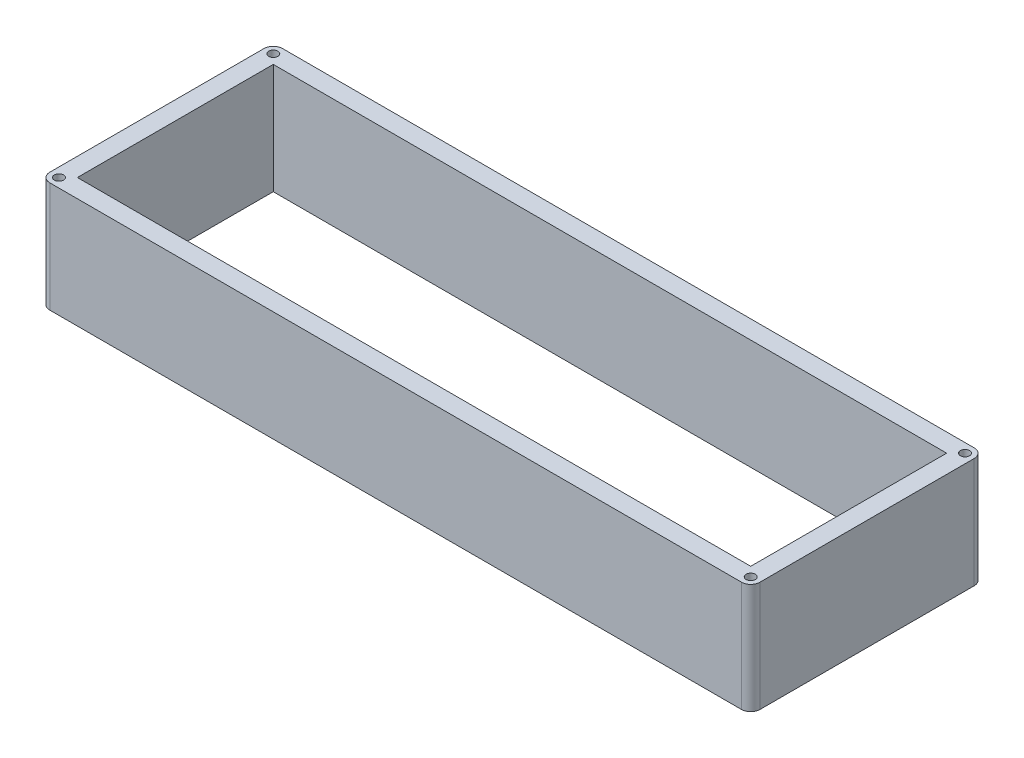
ISO-10303-21;
HEADER;
FILE_DESCRIPTION(('STEP AP214'),'2;1');
FILE_NAME('part.step','',(''),(''),'','','');
FILE_SCHEMA(('AUTOMOTIVE_DESIGN { 1 0 10303 214 1 1 1 1 }'));
ENDSEC;
DATA;
#1=APPLICATION_CONTEXT('core data for automotive mechanical design processes');
#2=APPLICATION_PROTOCOL_DEFINITION('international standard','automotive_design',2000,#1);
#3=PRODUCT_CONTEXT('',#1,'mechanical');
#4=PRODUCT('Part','Part','',(#3));
#5=PRODUCT_RELATED_PRODUCT_CATEGORY('part','',(#4));
#6=PRODUCT_DEFINITION_FORMATION('','',#4);
#7=PRODUCT_DEFINITION_CONTEXT('part definition',#1,'design');
#8=PRODUCT_DEFINITION('design','',#6,#7);
#9=PRODUCT_DEFINITION_SHAPE('','',#8);
#10=(LENGTH_UNIT() NAMED_UNIT(*) SI_UNIT(.MILLI.,.METRE.));
#11=(NAMED_UNIT(*) PLANE_ANGLE_UNIT() SI_UNIT($,.RADIAN.));
#12=(NAMED_UNIT(*) SI_UNIT($,.STERADIAN.) SOLID_ANGLE_UNIT());
#13=UNCERTAINTY_MEASURE_WITH_UNIT(LENGTH_MEASURE(1.E-05),#10,'distance_accuracy_value','');
#14=(GEOMETRIC_REPRESENTATION_CONTEXT(3) GLOBAL_UNCERTAINTY_ASSIGNED_CONTEXT((#13)) GLOBAL_UNIT_ASSIGNED_CONTEXT((#10,
#11,#12)) REPRESENTATION_CONTEXT('',''));
#15=CARTESIAN_POINT('',(0.,0.,0.));
#16=DIRECTION('',(0.,0.,1.));
#17=DIRECTION('',(1.,0.,0.));
#18=AXIS2_PLACEMENT_3D('',#15,#16,#17);
#19=CARTESIAN_POINT('',(0.,76.2,0.));
#20=DIRECTION('',(0.,1.,0.));
#21=DIRECTION('',(0.,0.,1.));
#22=AXIS2_PLACEMENT_3D('',#19,#20,#21);
#23=PLANE('',#22);
#24=CARTESIAN_POINT('',(-478.020000372,76.2,148.082));
#25=DIRECTION('',(0.,1.,0.));
#26=DIRECTION('',(0.,0.,1.));
#27=AXIS2_PLACEMENT_3D('',#24,#25,#26);
#28=CIRCLE('',#27,3.17499999999997);
#29=CARTESIAN_POINT('',(-478.020000372,76.2,144.907));
#30=VERTEX_POINT('',#29);
#31=EDGE_CURVE('E185',#30,#30,#28,.T.);
#32=ORIENTED_EDGE('',*,*,#31,.F.);
#33=EDGE_LOOP('',(#32));
#34=FACE_BOUND('',#33,.T.);
#35=CARTESIAN_POINT('',(-1.11022302462516E-13,76.2,148.082));
#36=DIRECTION('',(0.,1.,0.));
#37=DIRECTION('',(0.,0.,1.));
#38=AXIS2_PLACEMENT_3D('',#35,#36,#37);
#39=CIRCLE('',#38,3.17499999999997);
#40=CARTESIAN_POINT('',(-1.11022302462516E-13,76.2,144.907));
#41=VERTEX_POINT('',#40);
#42=EDGE_CURVE('E201',#41,#41,#39,.T.);
#43=ORIENTED_EDGE('',*,*,#42,.F.);
#44=EDGE_LOOP('',(#43));
#45=FACE_BOUND('',#44,.T.);
#46=CARTESIAN_POINT('',(0.,76.2,0.));
#47=DIRECTION('',(0.,1.,0.));
#48=DIRECTION('',(0.,0.,1.));
#49=AXIS2_PLACEMENT_3D('',#46,#47,#48);
#50=CIRCLE('',#49,6.34999999999998);
#51=CARTESIAN_POINT('',(6.34999999999997,76.2,0.));
#52=VERTEX_POINT('',#51);
#53=CARTESIAN_POINT('',(0.,76.2,-6.34999999999999));
#54=VERTEX_POINT('',#53);
#55=EDGE_CURVE('E209',#52,#54,#50,.T.);
#56=ORIENTED_EDGE('',*,*,#55,.T.);
#57=DIRECTION('',(-1.,0.,0.));
#58=VECTOR('',#57,1.);
#59=CARTESIAN_POINT('',(0.,76.2,-6.34999999999999));
#60=LINE('',#59,#58);
#61=CARTESIAN_POINT('',(-478.020000372,76.2,-6.34999999999999));
#62=VERTEX_POINT('',#61);
#63=EDGE_CURVE('E213',#54,#62,#60,.T.);
#64=ORIENTED_EDGE('',*,*,#63,.T.);
#65=CARTESIAN_POINT('',(-478.020000372,76.2,0.));
#66=DIRECTION('',(0.,1.,0.));
#67=DIRECTION('',(0.,0.,1.));
#68=AXIS2_PLACEMENT_3D('',#65,#66,#67);
#69=CIRCLE('',#68,6.35000000000001);
#70=CARTESIAN_POINT('',(-484.370000372,76.2,0.));
#71=VERTEX_POINT('',#70);
#72=EDGE_CURVE('E217',#62,#71,#69,.T.);
#73=ORIENTED_EDGE('',*,*,#72,.T.);
#74=DIRECTION('',(0.,0.,1.));
#75=VECTOR('',#74,1.);
#76=CARTESIAN_POINT('',(-484.370000372,76.2,0.));
#77=LINE('',#76,#75);
#78=CARTESIAN_POINT('',(-484.370000372,76.2,148.082));
#79=VERTEX_POINT('',#78);
#80=EDGE_CURVE('E220',#71,#79,#77,.T.);
#81=ORIENTED_EDGE('',*,*,#80,.T.);
#82=CARTESIAN_POINT('',(-478.020000372,76.2,148.082));
#83=DIRECTION('',(0.,1.,0.));
#84=DIRECTION('',(0.,0.,1.));
#85=AXIS2_PLACEMENT_3D('',#82,#83,#84);
#86=CIRCLE('',#85,6.35000000000002);
#87=CARTESIAN_POINT('',(-478.020000372,76.2,154.432));
#88=VERTEX_POINT('',#87);
#89=EDGE_CURVE('E223',#79,#88,#86,.T.);
#90=ORIENTED_EDGE('',*,*,#89,.T.);
#91=DIRECTION('',(1.,0.,0.));
#92=VECTOR('',#91,1.);
#93=CARTESIAN_POINT('',(-478.020000372,76.2,154.432));
#94=LINE('',#93,#92);
#95=CARTESIAN_POINT('',(-1.11022302462516E-13,76.2,154.432));
#96=VERTEX_POINT('',#95);
#97=EDGE_CURVE('E226',#88,#96,#94,.T.);
#98=ORIENTED_EDGE('',*,*,#97,.T.);
#99=CARTESIAN_POINT('',(-1.11022302462516E-13,76.2,148.082));
#100=DIRECTION('',(0.,1.,0.));
#101=DIRECTION('',(0.,0.,1.));
#102=AXIS2_PLACEMENT_3D('',#99,#100,#101);
#103=CIRCLE('',#102,6.34999999999999);
#104=CARTESIAN_POINT('',(6.34999999999988,76.2,148.082));
#105=VERTEX_POINT('',#104);
#106=EDGE_CURVE('E229',#96,#105,#103,.T.);
#107=ORIENTED_EDGE('',*,*,#106,.T.);
#108=DIRECTION('',(0.,0.,-1.));
#109=VECTOR('',#108,1.);
#110=CARTESIAN_POINT('',(6.34999999999986,76.2,148.082));
#111=LINE('',#110,#109);
#112=EDGE_CURVE('E232',#105,#52,#111,.T.);
#113=ORIENTED_EDGE('',*,*,#112,.T.);
#114=EDGE_LOOP('',(#56,#64,#73,#81,#90,#98,#107,#113));
#115=FACE_BOUND('',#114,.T.);
#116=CARTESIAN_POINT('',(0.,76.2,0.));
#117=DIRECTION('',(0.,1.,0.));
#118=DIRECTION('',(0.,0.,1.));
#119=AXIS2_PLACEMENT_3D('',#116,#117,#118);
#120=CIRCLE('',#119,3.17499999999997);
#121=CARTESIAN_POINT('',(0.,76.2,-3.17499999999997));
#122=VERTEX_POINT('',#121);
#123=EDGE_CURVE('E193',#122,#122,#120,.T.);
#124=ORIENTED_EDGE('',*,*,#123,.F.);
#125=EDGE_LOOP('',(#124));
#126=FACE_BOUND('',#125,.T.);
#127=CARTESIAN_POINT('',(-478.020000372,76.2,0.));
#128=DIRECTION('',(0.,1.,0.));
#129=DIRECTION('',(0.,0.,1.));
#130=AXIS2_PLACEMENT_3D('',#127,#128,#129);
#131=CIRCLE('',#130,3.17500000000002);
#132=CARTESIAN_POINT('',(-478.020000372,76.2,-3.17500000000002));
#133=VERTEX_POINT('',#132);
#134=EDGE_CURVE('E177',#133,#133,#131,.T.);
#135=ORIENTED_EDGE('',*,*,#134,.F.);
#136=EDGE_LOOP('',(#135));
#137=FACE_BOUND('',#136,.T.);
#138=DIRECTION('',(-1.,0.,0.));
#139=VECTOR('',#138,1.);
#140=CARTESIAN_POINT('',(-6.35000000000013,76.2,6.35));
#141=LINE('',#140,#139);
#142=CARTESIAN_POINT('',(-6.35000000000013,76.2,6.35));
#143=VERTEX_POINT('',#142);
#144=CARTESIAN_POINT('',(-471.670000372,76.2,6.35));
#145=VERTEX_POINT('',#144);
#146=EDGE_CURVE('E138',#143,#145,#141,.T.);
#147=ORIENTED_EDGE('',*,*,#146,.F.);
#148=DIRECTION('',(0.,0.,-1.));
#149=VECTOR('',#148,1.);
#150=CARTESIAN_POINT('',(-6.35000000000013,76.2,141.732));
#151=LINE('',#150,#149);
#152=CARTESIAN_POINT('',(-6.35000000000013,76.2,141.732));
#153=VERTEX_POINT('',#152);
#154=EDGE_CURVE('E129',#153,#143,#151,.T.);
#155=ORIENTED_EDGE('',*,*,#154,.F.);
#156=DIRECTION('',(1.,0.,0.));
#157=VECTOR('',#156,1.);
#158=CARTESIAN_POINT('',(-471.670000372,76.2,141.732));
#159=LINE('',#158,#157);
#160=CARTESIAN_POINT('',(-471.670000372,76.2,141.732));
#161=VERTEX_POINT('',#160);
#162=EDGE_CURVE('E155',#161,#153,#159,.T.);
#163=ORIENTED_EDGE('',*,*,#162,.F.);
#164=DIRECTION('',(0.,0.,1.));
#165=VECTOR('',#164,1.);
#166=CARTESIAN_POINT('',(-471.670000372,76.2,6.35));
#167=LINE('',#166,#165);
#168=EDGE_CURVE('E151',#145,#161,#167,.T.);
#169=ORIENTED_EDGE('',*,*,#168,.F.);
#170=EDGE_LOOP('',(#147,#155,#163,#169));
#171=FACE_BOUND('',#170,.T.);
#172=ADVANCED_FACE('F39',(#34,#45,#115,#126,#137,#171),#23,.T.);
#173=CARTESIAN_POINT('',(0.,0.,0.));
#174=DIRECTION('',(0.,1.,0.));
#175=DIRECTION('',(0.,0.,1.));
#176=AXIS2_PLACEMENT_3D('',#173,#174,#175);
#177=PLANE('',#176);
#178=CARTESIAN_POINT('',(-478.020000372,0.,0.));
#179=DIRECTION('',(0.,1.,0.));
#180=DIRECTION('',(0.,0.,1.));
#181=AXIS2_PLACEMENT_3D('',#178,#179,#180);
#182=CIRCLE('',#181,3.17500000000002);
#183=CARTESIAN_POINT('',(-478.020000372,0.,-3.17500000000002));
#184=VERTEX_POINT('',#183);
#185=EDGE_CURVE('E147',#184,#184,#182,.T.);
#186=ORIENTED_EDGE('',*,*,#185,.T.);
#187=EDGE_LOOP('',(#186));
#188=FACE_BOUND('',#187,.T.);
#189=CARTESIAN_POINT('',(-478.020000372,0.,148.082));
#190=DIRECTION('',(0.,1.,0.));
#191=DIRECTION('',(0.,0.,1.));
#192=AXIS2_PLACEMENT_3D('',#189,#190,#191);
#193=CIRCLE('',#192,3.17499999999997);
#194=CARTESIAN_POINT('',(-478.020000372,0.,144.907));
#195=VERTEX_POINT('',#194);
#196=EDGE_CURVE('E181',#195,#195,#193,.T.);
#197=ORIENTED_EDGE('',*,*,#196,.T.);
#198=EDGE_LOOP('',(#197));
#199=FACE_BOUND('',#198,.T.);
#200=CARTESIAN_POINT('',(0.,0.,0.));
#201=DIRECTION('',(0.,1.,0.));
#202=DIRECTION('',(0.,0.,1.));
#203=AXIS2_PLACEMENT_3D('',#200,#201,#202);
#204=CIRCLE('',#203,3.17499999999997);
#205=CARTESIAN_POINT('',(0.,0.,-3.17499999999997));
#206=VERTEX_POINT('',#205);
#207=EDGE_CURVE('E189',#206,#206,#204,.T.);
#208=ORIENTED_EDGE('',*,*,#207,.T.);
#209=EDGE_LOOP('',(#208));
#210=FACE_BOUND('',#209,.T.);
#211=CARTESIAN_POINT('',(-1.11022302462516E-13,0.,148.082));
#212=DIRECTION('',(0.,1.,0.));
#213=DIRECTION('',(0.,0.,1.));
#214=AXIS2_PLACEMENT_3D('',#211,#212,#213);
#215=CIRCLE('',#214,3.17499999999997);
#216=CARTESIAN_POINT('',(-1.11022302462516E-13,0.,144.907));
#217=VERTEX_POINT('',#216);
#218=EDGE_CURVE('E197',#217,#217,#215,.T.);
#219=ORIENTED_EDGE('',*,*,#218,.T.);
#220=EDGE_LOOP('',(#219));
#221=FACE_BOUND('',#220,.T.);
#222=CARTESIAN_POINT('',(0.,0.,0.));
#223=DIRECTION('',(0.,1.,0.));
#224=DIRECTION('',(0.,0.,1.));
#225=AXIS2_PLACEMENT_3D('',#222,#223,#224);
#226=CIRCLE('',#225,6.34999999999998);
#227=CARTESIAN_POINT('',(6.34999999999997,0.,0.));
#228=VERTEX_POINT('',#227);
#229=CARTESIAN_POINT('',(0.,0.,-6.34999999999999));
#230=VERTEX_POINT('',#229);
#231=EDGE_CURVE('E205',#228,#230,#226,.T.);
#232=ORIENTED_EDGE('',*,*,#231,.F.);
#233=DIRECTION('',(0.,0.,-1.));
#234=VECTOR('',#233,1.);
#235=CARTESIAN_POINT('',(6.34999999999986,0.,148.082));
#236=LINE('',#235,#234);
#237=CARTESIAN_POINT('',(6.34999999999988,0.,148.082));
#238=VERTEX_POINT('',#237);
#239=EDGE_CURVE('E214',#238,#228,#236,.T.);
#240=ORIENTED_EDGE('',*,*,#239,.F.);
#241=CARTESIAN_POINT('',(-1.11022302462516E-13,0.,148.082));
#242=DIRECTION('',(0.,1.,0.));
#243=DIRECTION('',(0.,0.,1.));
#244=AXIS2_PLACEMENT_3D('',#241,#242,#243);
#245=CIRCLE('',#244,6.34999999999999);
#246=CARTESIAN_POINT('',(-1.11022302462516E-13,0.,154.432));
#247=VERTEX_POINT('',#246);
#248=EDGE_CURVE('E254',#247,#238,#245,.T.);
#249=ORIENTED_EDGE('',*,*,#248,.F.);
#250=DIRECTION('',(1.,0.,0.));
#251=VECTOR('',#250,1.);
#252=CARTESIAN_POINT('',(-478.020000372,0.,154.432));
#253=LINE('',#252,#251);
#254=CARTESIAN_POINT('',(-478.020000372,0.,154.432));
#255=VERTEX_POINT('',#254);
#256=EDGE_CURVE('E251',#255,#247,#253,.T.);
#257=ORIENTED_EDGE('',*,*,#256,.F.);
#258=CARTESIAN_POINT('',(-478.020000372,0.,148.082));
#259=DIRECTION('',(0.,1.,0.));
#260=DIRECTION('',(0.,0.,1.));
#261=AXIS2_PLACEMENT_3D('',#258,#259,#260);
#262=CIRCLE('',#261,6.35000000000002);
#263=CARTESIAN_POINT('',(-484.370000372,0.,148.082));
#264=VERTEX_POINT('',#263);
#265=EDGE_CURVE('E248',#264,#255,#262,.T.);
#266=ORIENTED_EDGE('',*,*,#265,.F.);
#267=DIRECTION('',(0.,0.,1.));
#268=VECTOR('',#267,1.);
#269=CARTESIAN_POINT('',(-484.370000372,0.,0.));
#270=LINE('',#269,#268);
#271=CARTESIAN_POINT('',(-484.370000372,0.,0.));
#272=VERTEX_POINT('',#271);
#273=EDGE_CURVE('E245',#272,#264,#270,.T.);
#274=ORIENTED_EDGE('',*,*,#273,.F.);
#275=CARTESIAN_POINT('',(-478.020000372,0.,0.));
#276=DIRECTION('',(0.,1.,0.));
#277=DIRECTION('',(0.,0.,1.));
#278=AXIS2_PLACEMENT_3D('',#275,#276,#277);
#279=CIRCLE('',#278,6.35000000000001);
#280=CARTESIAN_POINT('',(-478.020000372,0.,-6.34999999999999));
#281=VERTEX_POINT('',#280);
#282=EDGE_CURVE('E242',#281,#272,#279,.T.);
#283=ORIENTED_EDGE('',*,*,#282,.F.);
#284=DIRECTION('',(-1.,0.,0.));
#285=VECTOR('',#284,1.);
#286=CARTESIAN_POINT('',(0.,0.,-6.34999999999999));
#287=LINE('',#286,#285);
#288=EDGE_CURVE('E239',#230,#281,#287,.T.);
#289=ORIENTED_EDGE('',*,*,#288,.F.);
#290=EDGE_LOOP('',(#232,#240,#249,#257,#266,#274,#283,#289));
#291=FACE_BOUND('',#290,.T.);
#292=DIRECTION('',(0.,0.,-1.));
#293=VECTOR('',#292,1.);
#294=CARTESIAN_POINT('',(-6.35000000000013,0.,141.732));
#295=LINE('',#294,#293);
#296=CARTESIAN_POINT('',(-6.35000000000013,0.,141.732));
#297=VERTEX_POINT('',#296);
#298=CARTESIAN_POINT('',(-6.35000000000013,0.,6.35));
#299=VERTEX_POINT('',#298);
#300=EDGE_CURVE('E63',#297,#299,#295,.T.);
#301=ORIENTED_EDGE('',*,*,#300,.T.);
#302=DIRECTION('',(-1.,0.,0.));
#303=VECTOR('',#302,1.);
#304=CARTESIAN_POINT('',(-6.35000000000013,0.,6.35));
#305=LINE('',#304,#303);
#306=CARTESIAN_POINT('',(-471.670000372,0.,6.35));
#307=VERTEX_POINT('',#306);
#308=EDGE_CURVE('E145',#299,#307,#305,.T.);
#309=ORIENTED_EDGE('',*,*,#308,.T.);
#310=DIRECTION('',(0.,0.,1.));
#311=VECTOR('',#310,1.);
#312=CARTESIAN_POINT('',(-471.670000372,0.,6.35));
#313=LINE('',#312,#311);
#314=CARTESIAN_POINT('',(-471.670000372,0.,141.732));
#315=VERTEX_POINT('',#314);
#316=EDGE_CURVE('E164',#307,#315,#313,.T.);
#317=ORIENTED_EDGE('',*,*,#316,.T.);
#318=DIRECTION('',(1.,0.,0.));
#319=VECTOR('',#318,1.);
#320=CARTESIAN_POINT('',(-471.670000372,0.,141.732));
#321=LINE('',#320,#319);
#322=EDGE_CURVE('E139',#315,#297,#321,.T.);
#323=ORIENTED_EDGE('',*,*,#322,.T.);
#324=EDGE_LOOP('',(#301,#309,#317,#323));
#325=FACE_BOUND('',#324,.T.);
#326=ADVANCED_FACE('F293',(#188,#199,#210,#221,#291,#325),#177,.F.);
#327=CARTESIAN_POINT('',(0.,76.2,0.));
#328=DIRECTION('',(0.,-1.,0.));
#329=DIRECTION('',(0.,0.,-1.));
#330=AXIS2_PLACEMENT_3D('',#327,#328,#329);
#331=CYLINDRICAL_SURFACE('',#330,6.34999999999998);
#332=ORIENTED_EDGE('',*,*,#231,.T.);
#333=DIRECTION('',(0.,-1.,0.));
#334=VECTOR('',#333,1.);
#335=CARTESIAN_POINT('',(0.,76.2,-6.34999999999999));
#336=LINE('',#335,#334);
#337=EDGE_CURVE('E11',#54,#230,#336,.T.);
#338=ORIENTED_EDGE('',*,*,#337,.F.);
#339=ORIENTED_EDGE('',*,*,#55,.F.);
#340=DIRECTION('',(0.,-1.,0.));
#341=VECTOR('',#340,1.);
#342=CARTESIAN_POINT('',(6.34999999999997,76.2,0.));
#343=LINE('',#342,#341);
#344=EDGE_CURVE('E235',#52,#228,#343,.T.);
#345=ORIENTED_EDGE('',*,*,#344,.T.);
#346=EDGE_LOOP('',(#332,#338,#339,#345));
#347=FACE_BOUND('',#346,.T.);
#348=ADVANCED_FACE('F41',(#347),#331,.T.);
#349=CARTESIAN_POINT('',(0.,76.2,-6.34999999999999));
#350=DIRECTION('',(0.,0.,1.));
#351=DIRECTION('',(1.,0.,0.));
#352=AXIS2_PLACEMENT_3D('',#349,#350,#351);
#353=PLANE('',#352);
#354=ORIENTED_EDGE('',*,*,#288,.T.);
#355=DIRECTION('',(0.,-1.,0.));
#356=VECTOR('',#355,1.);
#357=CARTESIAN_POINT('',(-478.020000372,76.2,-6.34999999999999));
#358=LINE('',#357,#356);
#359=EDGE_CURVE('E48',#62,#281,#358,.T.);
#360=ORIENTED_EDGE('',*,*,#359,.F.);
#361=ORIENTED_EDGE('',*,*,#63,.F.);
#362=ORIENTED_EDGE('',*,*,#337,.T.);
#363=EDGE_LOOP('',(#354,#360,#361,#362));
#364=FACE_BOUND('',#363,.T.);
#365=ADVANCED_FACE('F311',(#364),#353,.F.);
#366=CARTESIAN_POINT('',(-478.020000372,76.2,0.));
#367=DIRECTION('',(0.,-1.,0.));
#368=DIRECTION('',(0.,0.,-1.));
#369=AXIS2_PLACEMENT_3D('',#366,#367,#368);
#370=CYLINDRICAL_SURFACE('',#369,6.35000000000001);
#371=ORIENTED_EDGE('',*,*,#282,.T.);
#372=DIRECTION('',(0.,-1.,0.));
#373=VECTOR('',#372,1.);
#374=CARTESIAN_POINT('',(-484.370000372,76.2,0.));
#375=LINE('',#374,#373);
#376=EDGE_CURVE('E278',#71,#272,#375,.T.);
#377=ORIENTED_EDGE('',*,*,#376,.F.);
#378=ORIENTED_EDGE('',*,*,#72,.F.);
#379=ORIENTED_EDGE('',*,*,#359,.T.);
#380=EDGE_LOOP('',(#371,#377,#378,#379));
#381=FACE_BOUND('',#380,.T.);
#382=ADVANCED_FACE('F287',(#381),#370,.T.);
#383=CARTESIAN_POINT('',(-484.370000372,76.2,0.));
#384=DIRECTION('',(1.,0.,0.));
#385=DIRECTION('',(0.,0.,-1.));
#386=AXIS2_PLACEMENT_3D('',#383,#384,#385);
#387=PLANE('',#386);
#388=ORIENTED_EDGE('',*,*,#273,.T.);
#389=DIRECTION('',(0.,-1.,0.));
#390=VECTOR('',#389,1.);
#391=CARTESIAN_POINT('',(-484.370000372,76.2,148.082));
#392=LINE('',#391,#390);
#393=EDGE_CURVE('E274',#79,#264,#392,.T.);
#394=ORIENTED_EDGE('',*,*,#393,.F.);
#395=ORIENTED_EDGE('',*,*,#80,.F.);
#396=ORIENTED_EDGE('',*,*,#376,.T.);
#397=EDGE_LOOP('',(#388,#394,#395,#396));
#398=FACE_BOUND('',#397,.T.);
#399=ADVANCED_FACE('F299',(#398),#387,.F.);
#400=CARTESIAN_POINT('',(-478.020000372,76.2,148.082));
#401=DIRECTION('',(0.,-1.,0.));
#402=DIRECTION('',(0.,0.,-1.));
#403=AXIS2_PLACEMENT_3D('',#400,#401,#402);
#404=CYLINDRICAL_SURFACE('',#403,6.35000000000002);
#405=ORIENTED_EDGE('',*,*,#265,.T.);
#406=DIRECTION('',(0.,-1.,0.));
#407=VECTOR('',#406,1.);
#408=CARTESIAN_POINT('',(-478.020000372,76.2,154.432));
#409=LINE('',#408,#407);
#410=EDGE_CURVE('E270',#88,#255,#409,.T.);
#411=ORIENTED_EDGE('',*,*,#410,.F.);
#412=ORIENTED_EDGE('',*,*,#89,.F.);
#413=ORIENTED_EDGE('',*,*,#393,.T.);
#414=EDGE_LOOP('',(#405,#411,#412,#413));
#415=FACE_BOUND('',#414,.T.);
#416=ADVANCED_FACE('F303',(#415),#404,.T.);
#417=CARTESIAN_POINT('',(-478.020000372,76.2,154.432));
#418=DIRECTION('',(0.,0.,-1.));
#419=DIRECTION('',(-1.,0.,0.));
#420=AXIS2_PLACEMENT_3D('',#417,#418,#419);
#421=PLANE('',#420);
#422=ORIENTED_EDGE('',*,*,#256,.T.);
#423=DIRECTION('',(0.,-1.,0.));
#424=VECTOR('',#423,1.);
#425=CARTESIAN_POINT('',(-1.11022302462516E-13,76.2,154.432));
#426=LINE('',#425,#424);
#427=EDGE_CURVE('E266',#96,#247,#426,.T.);
#428=ORIENTED_EDGE('',*,*,#427,.F.);
#429=ORIENTED_EDGE('',*,*,#97,.F.);
#430=ORIENTED_EDGE('',*,*,#410,.T.);
#431=EDGE_LOOP('',(#422,#428,#429,#430));
#432=FACE_BOUND('',#431,.T.);
#433=ADVANCED_FACE('F324',(#432),#421,.F.);
#434=CARTESIAN_POINT('',(-1.11022302462516E-13,76.2,148.082));
#435=DIRECTION('',(0.,-1.,0.));
#436=DIRECTION('',(0.,0.,-1.));
#437=AXIS2_PLACEMENT_3D('',#434,#435,#436);
#438=CYLINDRICAL_SURFACE('',#437,6.34999999999999);
#439=ORIENTED_EDGE('',*,*,#248,.T.);
#440=DIRECTION('',(0.,-1.,0.));
#441=VECTOR('',#440,1.);
#442=CARTESIAN_POINT('',(6.34999999999988,76.2,148.082));
#443=LINE('',#442,#441);
#444=EDGE_CURVE('E262',#105,#238,#443,.T.);
#445=ORIENTED_EDGE('',*,*,#444,.F.);
#446=ORIENTED_EDGE('',*,*,#106,.F.);
#447=ORIENTED_EDGE('',*,*,#427,.T.);
#448=EDGE_LOOP('',(#439,#445,#446,#447));
#449=FACE_BOUND('',#448,.T.);
#450=ADVANCED_FACE('F322',(#449),#438,.T.);
#451=CARTESIAN_POINT('',(6.34999999999986,76.2,148.082));
#452=DIRECTION('',(-1.,0.,0.));
#453=DIRECTION('',(0.,0.,1.));
#454=AXIS2_PLACEMENT_3D('',#451,#452,#453);
#455=PLANE('',#454);
#456=ORIENTED_EDGE('',*,*,#239,.T.);
#457=ORIENTED_EDGE('',*,*,#344,.F.);
#458=ORIENTED_EDGE('',*,*,#112,.F.);
#459=ORIENTED_EDGE('',*,*,#444,.T.);
#460=EDGE_LOOP('',(#456,#457,#458,#459));
#461=FACE_BOUND('',#460,.T.);
#462=ADVANCED_FACE('F317',(#461),#455,.F.);
#463=CARTESIAN_POINT('',(-1.11022302462516E-13,76.2,148.082));
#464=DIRECTION('',(0.,-1.,0.));
#465=DIRECTION('',(0.,0.,-1.));
#466=AXIS2_PLACEMENT_3D('',#463,#464,#465);
#467=CYLINDRICAL_SURFACE('',#466,3.17499999999997);
#468=CARTESIAN_POINT('',(-1.11022302462516E-13,76.2,144.907));
#469=CARTESIAN_POINT('',(-1.11022302462516E-13,75.40625,144.907));
#470=CARTESIAN_POINT('',(-1.11022302462516E-13,74.6125,144.907));
#471=CARTESIAN_POINT('',(-1.11022302462516E-13,73.025,144.907));
#472=CARTESIAN_POINT('',(-1.11022302462516E-13,72.23125,144.907));
#473=CARTESIAN_POINT('',(-1.11022302462516E-13,70.64375,144.907));
#474=CARTESIAN_POINT('',(-1.11022302462516E-13,69.85,144.907));
#475=CARTESIAN_POINT('',(-1.11022302462516E-13,68.2625,144.907));
#476=CARTESIAN_POINT('',(-1.11022302462516E-13,67.46875,144.907));
#477=CARTESIAN_POINT('',(-1.11022302462516E-13,65.88125,144.907));
#478=CARTESIAN_POINT('',(-1.11022302462516E-13,65.0875,144.907));
#479=CARTESIAN_POINT('',(-1.11022302462516E-13,63.5,144.907));
#480=CARTESIAN_POINT('',(-1.11022302462516E-13,62.70625,144.907));
#481=CARTESIAN_POINT('',(-1.11022302462516E-13,61.11875,144.907));
#482=CARTESIAN_POINT('',(-1.11022302462516E-13,60.325,144.907));
#483=CARTESIAN_POINT('',(-1.11022302462516E-13,58.7375,144.907));
#484=CARTESIAN_POINT('',(-1.11022302462516E-13,57.94375,144.907));
#485=CARTESIAN_POINT('',(-1.11022302462516E-13,56.35625,144.907));
#486=CARTESIAN_POINT('',(-1.11022302462516E-13,55.5625,144.907));
#487=CARTESIAN_POINT('',(-1.11022302462516E-13,53.975,144.907));
#488=CARTESIAN_POINT('',(-1.11022302462516E-13,53.18125,144.907));
#489=CARTESIAN_POINT('',(-1.11022302462516E-13,51.59375,144.907));
#490=CARTESIAN_POINT('',(-1.11022302462516E-13,50.8,144.907));
#491=CARTESIAN_POINT('',(-1.11022302462516E-13,49.2125,144.907));
#492=CARTESIAN_POINT('',(-1.11022302462516E-13,48.41875,144.907));
#493=CARTESIAN_POINT('',(-1.11022302462516E-13,46.83125,144.907));
#494=CARTESIAN_POINT('',(-1.11022302462516E-13,46.0375,144.907));
#495=CARTESIAN_POINT('',(-1.11022302462516E-13,44.45,144.907));
#496=CARTESIAN_POINT('',(-1.11022302462516E-13,43.65625,144.907));
#497=CARTESIAN_POINT('',(-1.11022302462516E-13,42.06875,144.907));
#498=CARTESIAN_POINT('',(-1.11022302462516E-13,41.275,144.907));
#499=CARTESIAN_POINT('',(-1.11022302462516E-13,39.6875,144.907));
#500=CARTESIAN_POINT('',(-1.11022302462516E-13,38.89375,144.907));
#501=CARTESIAN_POINT('',(-1.11022302462516E-13,37.30625,144.907));
#502=CARTESIAN_POINT('',(-1.11022302462516E-13,36.5125,144.907));
#503=CARTESIAN_POINT('',(-1.11022302462516E-13,34.925,144.907));
#504=CARTESIAN_POINT('',(-1.11022302462516E-13,34.13125,144.907));
#505=CARTESIAN_POINT('',(-1.11022302462516E-13,32.54375,144.907));
#506=CARTESIAN_POINT('',(-1.11022302462516E-13,31.75,144.907));
#507=CARTESIAN_POINT('',(-1.11022302462516E-13,30.1625,144.907));
#508=CARTESIAN_POINT('',(-1.11022302462516E-13,29.36875,144.907));
#509=CARTESIAN_POINT('',(-1.11022302462516E-13,27.78125,144.907));
#510=CARTESIAN_POINT('',(-1.11022302462516E-13,26.9875,144.907));
#511=CARTESIAN_POINT('',(-1.11022302462516E-13,25.4,144.907));
#512=CARTESIAN_POINT('',(-1.11022302462516E-13,24.60625,144.907));
#513=CARTESIAN_POINT('',(-1.11022302462516E-13,23.01875,144.907));
#514=CARTESIAN_POINT('',(-1.11022302462516E-13,22.225,144.907));
#515=CARTESIAN_POINT('',(-1.11022302462516E-13,20.6375,144.907));
#516=CARTESIAN_POINT('',(-1.11022302462516E-13,19.84375,144.907));
#517=CARTESIAN_POINT('',(-1.11022302462516E-13,18.25625,144.907));
#518=CARTESIAN_POINT('',(-1.11022302462516E-13,17.4625,144.907));
#519=CARTESIAN_POINT('',(-1.11022302462516E-13,15.875,144.907));
#520=CARTESIAN_POINT('',(-1.11022302462516E-13,15.08125,144.907));
#521=CARTESIAN_POINT('',(-1.11022302462516E-13,13.49375,144.907));
#522=CARTESIAN_POINT('',(-1.11022302462516E-13,12.7,144.907));
#523=CARTESIAN_POINT('',(-1.11022302462516E-13,11.1125,144.907));
#524=CARTESIAN_POINT('',(-1.11022302462516E-13,10.31875,144.907));
#525=CARTESIAN_POINT('',(-1.11022302462516E-13,8.73125,144.907));
#526=CARTESIAN_POINT('',(-1.11022302462516E-13,7.93750000000001,144.907));
#527=CARTESIAN_POINT('',(-1.11022302462516E-13,6.35,144.907));
#528=CARTESIAN_POINT('',(-1.11022302462516E-13,5.55625,144.907));
#529=CARTESIAN_POINT('',(-1.11022302462516E-13,3.96875,144.907));
#530=CARTESIAN_POINT('',(-1.11022302462516E-13,3.175,144.907));
#531=CARTESIAN_POINT('',(-1.11022302462516E-13,1.5875,144.907));
#532=CARTESIAN_POINT('',(-1.11022302462516E-13,0.793750000000001,144.907));
#533=CARTESIAN_POINT('',(-1.11022302462516E-13,0.,144.907));
#534=B_SPLINE_CURVE_WITH_KNOTS('',3,(#468,#469,#470,#471,#472,#473,#474,#475,#476,#477,#478,
#479,#480,#481,#482,#483,#484,#485,#486,#487,#488,#489,#490,#491,#492,#493,#494,#495,#496,#497,
#498,#499,#500,#501,#502,#503,#504,#505,#506,#507,#508,#509,#510,#511,#512,#513,#514,#515,#516,
#517,#518,#519,#520,#521,#522,#523,#524,#525,#526,#527,#528,#529,#530,#531,#532,#533),
.UNSPECIFIED.,.F.,.F.,(4,2,2,2,2,2,2,2,2,2,2,2,2,2,2,2,2,2,2,2,2,2,2,2,2,2,2,2,2,2,2,2,4),(0.,
2.38125,4.7625,7.14375,9.52500000000001,11.90625,14.2875,16.66875,19.05,21.43125,23.8125,
26.19375,28.575,30.95625,33.3375,35.71875,38.1,40.48125,42.8625,45.24375,47.625,50.00625,
52.3875,54.76875,57.15,59.53125,61.9125,64.29375,66.675,69.05625,71.4375,73.81875,76.2),.UNSPECIFIED.);
#535=EDGE_CURVE('BSEAM344',#41,#217,#534,.T.);
#536=ORIENTED_EDGE('',*,*,#42,.T.);
#537=ORIENTED_EDGE('',*,*,#218,.F.);
#538=ORIENTED_EDGE('',*,*,#535,.T.);
#539=ORIENTED_EDGE('',*,*,#535,.F.);
#540=EDGE_LOOP('',(#536,#538,#537,#539));
#541=FACE_BOUND('',#540,.T.);
#542=ADVANCED_FACE('F344',(#541),#467,.F.);
#543=CARTESIAN_POINT('',(0.,76.2,0.));
#544=DIRECTION('',(0.,-1.,0.));
#545=DIRECTION('',(0.,0.,-1.));
#546=AXIS2_PLACEMENT_3D('',#543,#544,#545);
#547=CYLINDRICAL_SURFACE('',#546,3.17499999999997);
#548=CARTESIAN_POINT('',(0.,76.2,-3.17499999999997));
#549=CARTESIAN_POINT('',(0.,75.40625,-3.17499999999997));
#550=CARTESIAN_POINT('',(0.,74.6125,-3.17499999999997));
#551=CARTESIAN_POINT('',(0.,73.025,-3.17499999999997));
#552=CARTESIAN_POINT('',(0.,72.23125,-3.17499999999997));
#553=CARTESIAN_POINT('',(0.,70.64375,-3.17499999999997));
#554=CARTESIAN_POINT('',(0.,69.85,-3.17499999999997));
#555=CARTESIAN_POINT('',(0.,68.2625,-3.17499999999997));
#556=CARTESIAN_POINT('',(0.,67.46875,-3.17499999999997));
#557=CARTESIAN_POINT('',(0.,65.88125,-3.17499999999997));
#558=CARTESIAN_POINT('',(0.,65.0875,-3.17499999999997));
#559=CARTESIAN_POINT('',(0.,63.5,-3.17499999999997));
#560=CARTESIAN_POINT('',(0.,62.70625,-3.17499999999997));
#561=CARTESIAN_POINT('',(0.,61.11875,-3.17499999999997));
#562=CARTESIAN_POINT('',(0.,60.325,-3.17499999999997));
#563=CARTESIAN_POINT('',(0.,58.7375,-3.17499999999997));
#564=CARTESIAN_POINT('',(0.,57.94375,-3.17499999999997));
#565=CARTESIAN_POINT('',(0.,56.35625,-3.17499999999997));
#566=CARTESIAN_POINT('',(0.,55.5625,-3.17499999999997));
#567=CARTESIAN_POINT('',(0.,53.975,-3.17499999999997));
#568=CARTESIAN_POINT('',(0.,53.18125,-3.17499999999997));
#569=CARTESIAN_POINT('',(0.,51.59375,-3.17499999999997));
#570=CARTESIAN_POINT('',(0.,50.8,-3.17499999999997));
#571=CARTESIAN_POINT('',(0.,49.2125,-3.17499999999997));
#572=CARTESIAN_POINT('',(0.,48.41875,-3.17499999999997));
#573=CARTESIAN_POINT('',(0.,46.83125,-3.17499999999997));
#574=CARTESIAN_POINT('',(0.,46.0375,-3.17499999999997));
#575=CARTESIAN_POINT('',(0.,44.45,-3.17499999999997));
#576=CARTESIAN_POINT('',(0.,43.65625,-3.17499999999997));
#577=CARTESIAN_POINT('',(0.,42.06875,-3.17499999999997));
#578=CARTESIAN_POINT('',(0.,41.275,-3.17499999999997));
#579=CARTESIAN_POINT('',(0.,39.6875,-3.17499999999997));
#580=CARTESIAN_POINT('',(0.,38.89375,-3.17499999999997));
#581=CARTESIAN_POINT('',(0.,37.30625,-3.17499999999997));
#582=CARTESIAN_POINT('',(0.,36.5125,-3.17499999999997));
#583=CARTESIAN_POINT('',(0.,34.925,-3.17499999999997));
#584=CARTESIAN_POINT('',(0.,34.13125,-3.17499999999997));
#585=CARTESIAN_POINT('',(0.,32.54375,-3.17499999999997));
#586=CARTESIAN_POINT('',(0.,31.75,-3.17499999999997));
#587=CARTESIAN_POINT('',(0.,30.1625,-3.17499999999997));
#588=CARTESIAN_POINT('',(0.,29.36875,-3.17499999999997));
#589=CARTESIAN_POINT('',(0.,27.78125,-3.17499999999997));
#590=CARTESIAN_POINT('',(0.,26.9875,-3.17499999999997));
#591=CARTESIAN_POINT('',(0.,25.4,-3.17499999999997));
#592=CARTESIAN_POINT('',(0.,24.60625,-3.17499999999997));
#593=CARTESIAN_POINT('',(0.,23.01875,-3.17499999999997));
#594=CARTESIAN_POINT('',(0.,22.225,-3.17499999999997));
#595=CARTESIAN_POINT('',(0.,20.6375,-3.17499999999997));
#596=CARTESIAN_POINT('',(0.,19.84375,-3.17499999999997));
#597=CARTESIAN_POINT('',(0.,18.25625,-3.17499999999997));
#598=CARTESIAN_POINT('',(0.,17.4625,-3.17499999999997));
#599=CARTESIAN_POINT('',(0.,15.875,-3.17499999999997));
#600=CARTESIAN_POINT('',(0.,15.08125,-3.17499999999997));
#601=CARTESIAN_POINT('',(0.,13.49375,-3.17499999999997));
#602=CARTESIAN_POINT('',(0.,12.7,-3.17499999999997));
#603=CARTESIAN_POINT('',(0.,11.1125,-3.17499999999997));
#604=CARTESIAN_POINT('',(0.,10.31875,-3.17499999999997));
#605=CARTESIAN_POINT('',(0.,8.73125,-3.17499999999997));
#606=CARTESIAN_POINT('',(0.,7.93750000000001,-3.17499999999997));
#607=CARTESIAN_POINT('',(0.,6.35,-3.17499999999997));
#608=CARTESIAN_POINT('',(0.,5.55625,-3.17499999999997));
#609=CARTESIAN_POINT('',(0.,3.96875,-3.17499999999997));
#610=CARTESIAN_POINT('',(0.,3.175,-3.17499999999997));
#611=CARTESIAN_POINT('',(0.,1.5875,-3.17499999999997));
#612=CARTESIAN_POINT('',(0.,0.793750000000001,-3.17499999999997));
#613=CARTESIAN_POINT('',(0.,0.,-3.17499999999997));
#614=B_SPLINE_CURVE_WITH_KNOTS('',3,(#548,#549,#550,#551,#552,#553,#554,#555,#556,#557,#558,
#559,#560,#561,#562,#563,#564,#565,#566,#567,#568,#569,#570,#571,#572,#573,#574,#575,#576,#577,
#578,#579,#580,#581,#582,#583,#584,#585,#586,#587,#588,#589,#590,#591,#592,#593,#594,#595,#596,
#597,#598,#599,#600,#601,#602,#603,#604,#605,#606,#607,#608,#609,#610,#611,#612,#613),
.UNSPECIFIED.,.F.,.F.,(4,2,2,2,2,2,2,2,2,2,2,2,2,2,2,2,2,2,2,2,2,2,2,2,2,2,2,2,2,2,2,2,4),(0.,
2.38125,4.7625,7.14375,9.52500000000001,11.90625,14.2875,16.66875,19.05,21.43125,23.8125,
26.19375,28.575,30.95625,33.3375,35.71875,38.1,40.48125,42.8625,45.24375,47.625,50.00625,
52.3875,54.76875,57.15,59.53125,61.9125,64.29375,66.675,69.05625,71.4375,73.81875,76.2),.UNSPECIFIED.);
#615=EDGE_CURVE('BSEAM351',#122,#206,#614,.T.);
#616=ORIENTED_EDGE('',*,*,#123,.T.);
#617=ORIENTED_EDGE('',*,*,#207,.F.);
#618=ORIENTED_EDGE('',*,*,#615,.T.);
#619=ORIENTED_EDGE('',*,*,#615,.F.);
#620=EDGE_LOOP('',(#616,#618,#617,#619));
#621=FACE_BOUND('',#620,.T.);
#622=ADVANCED_FACE('F351',(#621),#547,.F.);
#623=CARTESIAN_POINT('',(-478.020000372,76.2,148.082));
#624=DIRECTION('',(0.,-1.,0.));
#625=DIRECTION('',(0.,0.,-1.));
#626=AXIS2_PLACEMENT_3D('',#623,#624,#625);
#627=CYLINDRICAL_SURFACE('',#626,3.17499999999997);
#628=CARTESIAN_POINT('',(-478.020000372,76.2,144.907));
#629=CARTESIAN_POINT('',(-478.020000372,75.40625,144.907));
#630=CARTESIAN_POINT('',(-478.020000372,74.6125,144.907));
#631=CARTESIAN_POINT('',(-478.020000372,73.025,144.907));
#632=CARTESIAN_POINT('',(-478.020000372,72.23125,144.907));
#633=CARTESIAN_POINT('',(-478.020000372,70.64375,144.907));
#634=CARTESIAN_POINT('',(-478.020000372,69.85,144.907));
#635=CARTESIAN_POINT('',(-478.020000372,68.2625,144.907));
#636=CARTESIAN_POINT('',(-478.020000372,67.46875,144.907));
#637=CARTESIAN_POINT('',(-478.020000372,65.88125,144.907));
#638=CARTESIAN_POINT('',(-478.020000372,65.0875,144.907));
#639=CARTESIAN_POINT('',(-478.020000372,63.5,144.907));
#640=CARTESIAN_POINT('',(-478.020000372,62.70625,144.907));
#641=CARTESIAN_POINT('',(-478.020000372,61.11875,144.907));
#642=CARTESIAN_POINT('',(-478.020000372,60.325,144.907));
#643=CARTESIAN_POINT('',(-478.020000372,58.7375,144.907));
#644=CARTESIAN_POINT('',(-478.020000372,57.94375,144.907));
#645=CARTESIAN_POINT('',(-478.020000372,56.35625,144.907));
#646=CARTESIAN_POINT('',(-478.020000372,55.5625,144.907));
#647=CARTESIAN_POINT('',(-478.020000372,53.975,144.907));
#648=CARTESIAN_POINT('',(-478.020000372,53.18125,144.907));
#649=CARTESIAN_POINT('',(-478.020000372,51.59375,144.907));
#650=CARTESIAN_POINT('',(-478.020000372,50.8,144.907));
#651=CARTESIAN_POINT('',(-478.020000372,49.2125,144.907));
#652=CARTESIAN_POINT('',(-478.020000372,48.41875,144.907));
#653=CARTESIAN_POINT('',(-478.020000372,46.83125,144.907));
#654=CARTESIAN_POINT('',(-478.020000372,46.0375,144.907));
#655=CARTESIAN_POINT('',(-478.020000372,44.45,144.907));
#656=CARTESIAN_POINT('',(-478.020000372,43.65625,144.907));
#657=CARTESIAN_POINT('',(-478.020000372,42.06875,144.907));
#658=CARTESIAN_POINT('',(-478.020000372,41.275,144.907));
#659=CARTESIAN_POINT('',(-478.020000372,39.6875,144.907));
#660=CARTESIAN_POINT('',(-478.020000372,38.89375,144.907));
#661=CARTESIAN_POINT('',(-478.020000372,37.30625,144.907));
#662=CARTESIAN_POINT('',(-478.020000372,36.5125,144.907));
#663=CARTESIAN_POINT('',(-478.020000372,34.925,144.907));
#664=CARTESIAN_POINT('',(-478.020000372,34.13125,144.907));
#665=CARTESIAN_POINT('',(-478.020000372,32.54375,144.907));
#666=CARTESIAN_POINT('',(-478.020000372,31.75,144.907));
#667=CARTESIAN_POINT('',(-478.020000372,30.1625,144.907));
#668=CARTESIAN_POINT('',(-478.020000372,29.36875,144.907));
#669=CARTESIAN_POINT('',(-478.020000372,27.78125,144.907));
#670=CARTESIAN_POINT('',(-478.020000372,26.9875,144.907));
#671=CARTESIAN_POINT('',(-478.020000372,25.4,144.907));
#672=CARTESIAN_POINT('',(-478.020000372,24.60625,144.907));
#673=CARTESIAN_POINT('',(-478.020000372,23.01875,144.907));
#674=CARTESIAN_POINT('',(-478.020000372,22.225,144.907));
#675=CARTESIAN_POINT('',(-478.020000372,20.6375,144.907));
#676=CARTESIAN_POINT('',(-478.020000372,19.84375,144.907));
#677=CARTESIAN_POINT('',(-478.020000372,18.25625,144.907));
#678=CARTESIAN_POINT('',(-478.020000372,17.4625,144.907));
#679=CARTESIAN_POINT('',(-478.020000372,15.875,144.907));
#680=CARTESIAN_POINT('',(-478.020000372,15.08125,144.907));
#681=CARTESIAN_POINT('',(-478.020000372,13.49375,144.907));
#682=CARTESIAN_POINT('',(-478.020000372,12.7,144.907));
#683=CARTESIAN_POINT('',(-478.020000372,11.1125,144.907));
#684=CARTESIAN_POINT('',(-478.020000372,10.31875,144.907));
#685=CARTESIAN_POINT('',(-478.020000372,8.73125,144.907));
#686=CARTESIAN_POINT('',(-478.020000372,7.93750000000001,144.907));
#687=CARTESIAN_POINT('',(-478.020000372,6.35,144.907));
#688=CARTESIAN_POINT('',(-478.020000372,5.55625,144.907));
#689=CARTESIAN_POINT('',(-478.020000372,3.96875,144.907));
#690=CARTESIAN_POINT('',(-478.020000372,3.175,144.907));
#691=CARTESIAN_POINT('',(-478.020000372,1.5875,144.907));
#692=CARTESIAN_POINT('',(-478.020000372,0.793750000000001,144.907));
#693=CARTESIAN_POINT('',(-478.020000372,0.,144.907));
#694=B_SPLINE_CURVE_WITH_KNOTS('',3,(#628,#629,#630,#631,#632,#633,#634,#635,#636,#637,#638,
#639,#640,#641,#642,#643,#644,#645,#646,#647,#648,#649,#650,#651,#652,#653,#654,#655,#656,#657,
#658,#659,#660,#661,#662,#663,#664,#665,#666,#667,#668,#669,#670,#671,#672,#673,#674,#675,#676,
#677,#678,#679,#680,#681,#682,#683,#684,#685,#686,#687,#688,#689,#690,#691,#692,#693),
.UNSPECIFIED.,.F.,.F.,(4,2,2,2,2,2,2,2,2,2,2,2,2,2,2,2,2,2,2,2,2,2,2,2,2,2,2,2,2,2,2,2,4),(0.,
2.38125,4.7625,7.14375,9.52500000000001,11.90625,14.2875,16.66875,19.05,21.43125,23.8125,
26.19375,28.575,30.95625,33.3375,35.71875,38.1,40.48125,42.8625,45.24375,47.625,50.00625,
52.3875,54.76875,57.15,59.53125,61.9125,64.29375,66.675,69.05625,71.4375,73.81875,76.2),.UNSPECIFIED.);
#695=EDGE_CURVE('BSEAM356',#30,#195,#694,.T.);
#696=ORIENTED_EDGE('',*,*,#31,.T.);
#697=ORIENTED_EDGE('',*,*,#196,.F.);
#698=ORIENTED_EDGE('',*,*,#695,.T.);
#699=ORIENTED_EDGE('',*,*,#695,.F.);
#700=EDGE_LOOP('',(#696,#698,#697,#699));
#701=FACE_BOUND('',#700,.T.);
#702=ADVANCED_FACE('F356',(#701),#627,.F.);
#703=CARTESIAN_POINT('',(-478.020000372,76.2,0.));
#704=DIRECTION('',(0.,-1.,0.));
#705=DIRECTION('',(0.,0.,-1.));
#706=AXIS2_PLACEMENT_3D('',#703,#704,#705);
#707=CYLINDRICAL_SURFACE('',#706,3.17500000000002);
#708=CARTESIAN_POINT('',(-478.020000372,76.2,-3.17500000000002));
#709=CARTESIAN_POINT('',(-478.020000372,75.40625,-3.17500000000002));
#710=CARTESIAN_POINT('',(-478.020000372,74.6125,-3.17500000000002));
#711=CARTESIAN_POINT('',(-478.020000372,73.025,-3.17500000000002));
#712=CARTESIAN_POINT('',(-478.020000372,72.23125,-3.17500000000002));
#713=CARTESIAN_POINT('',(-478.020000372,70.64375,-3.17500000000002));
#714=CARTESIAN_POINT('',(-478.020000372,69.85,-3.17500000000002));
#715=CARTESIAN_POINT('',(-478.020000372,68.2625,-3.17500000000002));
#716=CARTESIAN_POINT('',(-478.020000372,67.46875,-3.17500000000002));
#717=CARTESIAN_POINT('',(-478.020000372,65.88125,-3.17500000000002));
#718=CARTESIAN_POINT('',(-478.020000372,65.0875,-3.17500000000002));
#719=CARTESIAN_POINT('',(-478.020000372,63.5,-3.17500000000002));
#720=CARTESIAN_POINT('',(-478.020000372,62.70625,-3.17500000000002));
#721=CARTESIAN_POINT('',(-478.020000372,61.11875,-3.17500000000002));
#722=CARTESIAN_POINT('',(-478.020000372,60.325,-3.17500000000002));
#723=CARTESIAN_POINT('',(-478.020000372,58.7375,-3.17500000000002));
#724=CARTESIAN_POINT('',(-478.020000372,57.94375,-3.17500000000002));
#725=CARTESIAN_POINT('',(-478.020000372,56.35625,-3.17500000000002));
#726=CARTESIAN_POINT('',(-478.020000372,55.5625,-3.17500000000002));
#727=CARTESIAN_POINT('',(-478.020000372,53.975,-3.17500000000002));
#728=CARTESIAN_POINT('',(-478.020000372,53.18125,-3.17500000000002));
#729=CARTESIAN_POINT('',(-478.020000372,51.59375,-3.17500000000002));
#730=CARTESIAN_POINT('',(-478.020000372,50.8,-3.17500000000002));
#731=CARTESIAN_POINT('',(-478.020000372,49.2125,-3.17500000000002));
#732=CARTESIAN_POINT('',(-478.020000372,48.41875,-3.17500000000002));
#733=CARTESIAN_POINT('',(-478.020000372,46.83125,-3.17500000000002));
#734=CARTESIAN_POINT('',(-478.020000372,46.0375,-3.17500000000002));
#735=CARTESIAN_POINT('',(-478.020000372,44.45,-3.17500000000002));
#736=CARTESIAN_POINT('',(-478.020000372,43.65625,-3.17500000000002));
#737=CARTESIAN_POINT('',(-478.020000372,42.06875,-3.17500000000002));
#738=CARTESIAN_POINT('',(-478.020000372,41.275,-3.17500000000002));
#739=CARTESIAN_POINT('',(-478.020000372,39.6875,-3.17500000000002));
#740=CARTESIAN_POINT('',(-478.020000372,38.89375,-3.17500000000002));
#741=CARTESIAN_POINT('',(-478.020000372,37.30625,-3.17500000000002));
#742=CARTESIAN_POINT('',(-478.020000372,36.5125,-3.17500000000002));
#743=CARTESIAN_POINT('',(-478.020000372,34.925,-3.17500000000002));
#744=CARTESIAN_POINT('',(-478.020000372,34.13125,-3.17500000000002));
#745=CARTESIAN_POINT('',(-478.020000372,32.54375,-3.17500000000002));
#746=CARTESIAN_POINT('',(-478.020000372,31.75,-3.17500000000002));
#747=CARTESIAN_POINT('',(-478.020000372,30.1625,-3.17500000000002));
#748=CARTESIAN_POINT('',(-478.020000372,29.36875,-3.17500000000002));
#749=CARTESIAN_POINT('',(-478.020000372,27.78125,-3.17500000000002));
#750=CARTESIAN_POINT('',(-478.020000372,26.9875,-3.17500000000002));
#751=CARTESIAN_POINT('',(-478.020000372,25.4,-3.17500000000002));
#752=CARTESIAN_POINT('',(-478.020000372,24.60625,-3.17500000000002));
#753=CARTESIAN_POINT('',(-478.020000372,23.01875,-3.17500000000002));
#754=CARTESIAN_POINT('',(-478.020000372,22.225,-3.17500000000002));
#755=CARTESIAN_POINT('',(-478.020000372,20.6375,-3.17500000000002));
#756=CARTESIAN_POINT('',(-478.020000372,19.84375,-3.17500000000002));
#757=CARTESIAN_POINT('',(-478.020000372,18.25625,-3.17500000000002));
#758=CARTESIAN_POINT('',(-478.020000372,17.4625,-3.17500000000002));
#759=CARTESIAN_POINT('',(-478.020000372,15.875,-3.17500000000002));
#760=CARTESIAN_POINT('',(-478.020000372,15.08125,-3.17500000000002));
#761=CARTESIAN_POINT('',(-478.020000372,13.49375,-3.17500000000002));
#762=CARTESIAN_POINT('',(-478.020000372,12.7,-3.17500000000002));
#763=CARTESIAN_POINT('',(-478.020000372,11.1125,-3.17500000000002));
#764=CARTESIAN_POINT('',(-478.020000372,10.31875,-3.17500000000002));
#765=CARTESIAN_POINT('',(-478.020000372,8.73125,-3.17500000000002));
#766=CARTESIAN_POINT('',(-478.020000372,7.93750000000001,-3.17500000000002));
#767=CARTESIAN_POINT('',(-478.020000372,6.35,-3.17500000000002));
#768=CARTESIAN_POINT('',(-478.020000372,5.55625,-3.17500000000002));
#769=CARTESIAN_POINT('',(-478.020000372,3.96875,-3.17500000000002));
#770=CARTESIAN_POINT('',(-478.020000372,3.175,-3.17500000000002));
#771=CARTESIAN_POINT('',(-478.020000372,1.5875,-3.17500000000002));
#772=CARTESIAN_POINT('',(-478.020000372,0.793750000000001,-3.17500000000002));
#773=CARTESIAN_POINT('',(-478.020000372,0.,-3.17500000000002));
#774=B_SPLINE_CURVE_WITH_KNOTS('',3,(#708,#709,#710,#711,#712,#713,#714,#715,#716,#717,#718,
#719,#720,#721,#722,#723,#724,#725,#726,#727,#728,#729,#730,#731,#732,#733,#734,#735,#736,#737,
#738,#739,#740,#741,#742,#743,#744,#745,#746,#747,#748,#749,#750,#751,#752,#753,#754,#755,#756,
#757,#758,#759,#760,#761,#762,#763,#764,#765,#766,#767,#768,#769,#770,#771,#772,#773),
.UNSPECIFIED.,.F.,.F.,(4,2,2,2,2,2,2,2,2,2,2,2,2,2,2,2,2,2,2,2,2,2,2,2,2,2,2,2,2,2,2,2,4),(0.,
2.38125,4.7625,7.14375,9.52500000000001,11.90625,14.2875,16.66875,19.05,21.43125,23.8125,
26.19375,28.575,30.95625,33.3375,35.71875,38.1,40.48125,42.8625,45.24375,47.625,50.00625,
52.3875,54.76875,57.15,59.53125,61.9125,64.29375,66.675,69.05625,71.4375,73.81875,76.2),.UNSPECIFIED.);
#775=EDGE_CURVE('BSEAM365',#133,#184,#774,.T.);
#776=ORIENTED_EDGE('',*,*,#134,.T.);
#777=ORIENTED_EDGE('',*,*,#185,.F.);
#778=ORIENTED_EDGE('',*,*,#775,.T.);
#779=ORIENTED_EDGE('',*,*,#775,.F.);
#780=EDGE_LOOP('',(#776,#778,#777,#779));
#781=FACE_BOUND('',#780,.T.);
#782=ADVANCED_FACE('F365',(#781),#707,.F.);
#783=CARTESIAN_POINT('',(-6.35000000000013,76.2,141.732));
#784=DIRECTION('',(-1.,0.,0.));
#785=DIRECTION('',(0.,0.,1.));
#786=AXIS2_PLACEMENT_3D('',#783,#784,#785);
#787=PLANE('',#786);
#788=ORIENTED_EDGE('',*,*,#300,.F.);
#789=DIRECTION('',(0.,-1.,0.));
#790=VECTOR('',#789,1.);
#791=CARTESIAN_POINT('',(-6.35000000000013,76.2,141.732));
#792=LINE('',#791,#790);
#793=EDGE_CURVE('E133',#153,#297,#792,.T.);
#794=ORIENTED_EDGE('',*,*,#793,.F.);
#795=ORIENTED_EDGE('',*,*,#154,.T.);
#796=DIRECTION('',(0.,-1.,0.));
#797=VECTOR('',#796,1.);
#798=CARTESIAN_POINT('',(-6.35000000000013,76.2,6.35));
#799=LINE('',#798,#797);
#800=EDGE_CURVE('E132',#143,#299,#799,.T.);
#801=ORIENTED_EDGE('',*,*,#800,.T.);
#802=EDGE_LOOP('',(#788,#794,#795,#801));
#803=FACE_BOUND('',#802,.T.);
#804=ADVANCED_FACE('F131',(#803),#787,.T.);
#805=CARTESIAN_POINT('',(-6.35000000000013,76.2,6.35));
#806=DIRECTION('',(0.,0.,1.));
#807=DIRECTION('',(1.,0.,0.));
#808=AXIS2_PLACEMENT_3D('',#805,#806,#807);
#809=PLANE('',#808);
#810=ORIENTED_EDGE('',*,*,#308,.F.);
#811=ORIENTED_EDGE('',*,*,#800,.F.);
#812=ORIENTED_EDGE('',*,*,#146,.T.);
#813=DIRECTION('',(0.,-1.,0.));
#814=VECTOR('',#813,1.);
#815=CARTESIAN_POINT('',(-471.670000372,76.2,6.35));
#816=LINE('',#815,#814);
#817=EDGE_CURVE('E148',#145,#307,#816,.T.);
#818=ORIENTED_EDGE('',*,*,#817,.T.);
#819=EDGE_LOOP('',(#810,#811,#812,#818));
#820=FACE_BOUND('',#819,.T.);
#821=ADVANCED_FACE('F142',(#820),#809,.T.);
#822=CARTESIAN_POINT('',(-471.670000372,76.2,6.35));
#823=DIRECTION('',(1.,0.,0.));
#824=DIRECTION('',(0.,0.,-1.));
#825=AXIS2_PLACEMENT_3D('',#822,#823,#824);
#826=PLANE('',#825);
#827=ORIENTED_EDGE('',*,*,#316,.F.);
#828=ORIENTED_EDGE('',*,*,#817,.F.);
#829=ORIENTED_EDGE('',*,*,#168,.T.);
#830=DIRECTION('',(0.,-1.,0.));
#831=VECTOR('',#830,1.);
#832=CARTESIAN_POINT('',(-471.670000372,76.2,141.732));
#833=LINE('',#832,#831);
#834=EDGE_CURVE('E55',#161,#315,#833,.T.);
#835=ORIENTED_EDGE('',*,*,#834,.T.);
#836=EDGE_LOOP('',(#827,#828,#829,#835));
#837=FACE_BOUND('',#836,.T.);
#838=ADVANCED_FACE('F377',(#837),#826,.T.);
#839=CARTESIAN_POINT('',(-471.670000372,76.2,141.732));
#840=DIRECTION('',(0.,0.,-1.));
#841=DIRECTION('',(-1.,0.,0.));
#842=AXIS2_PLACEMENT_3D('',#839,#840,#841);
#843=PLANE('',#842);
#844=ORIENTED_EDGE('',*,*,#322,.F.);
#845=ORIENTED_EDGE('',*,*,#834,.F.);
#846=ORIENTED_EDGE('',*,*,#162,.T.);
#847=ORIENTED_EDGE('',*,*,#793,.T.);
#848=EDGE_LOOP('',(#844,#845,#846,#847));
#849=FACE_BOUND('',#848,.T.);
#850=ADVANCED_FACE('F380',(#849),#843,.T.);
#851=CLOSED_SHELL('',(#172,#326,#348,#365,#382,#399,#416,#433,#450,#462,#542,#622,#702,#782,
#804,#821,#838,#850));
#852=MANIFOLD_SOLID_BREP('B2',#851);
#853=ADVANCED_BREP_SHAPE_REPRESENTATION('',(#18,#852),#14);
#854=SHAPE_DEFINITION_REPRESENTATION(#9,#853);
ENDSEC;
END-ISO-10303-21;
